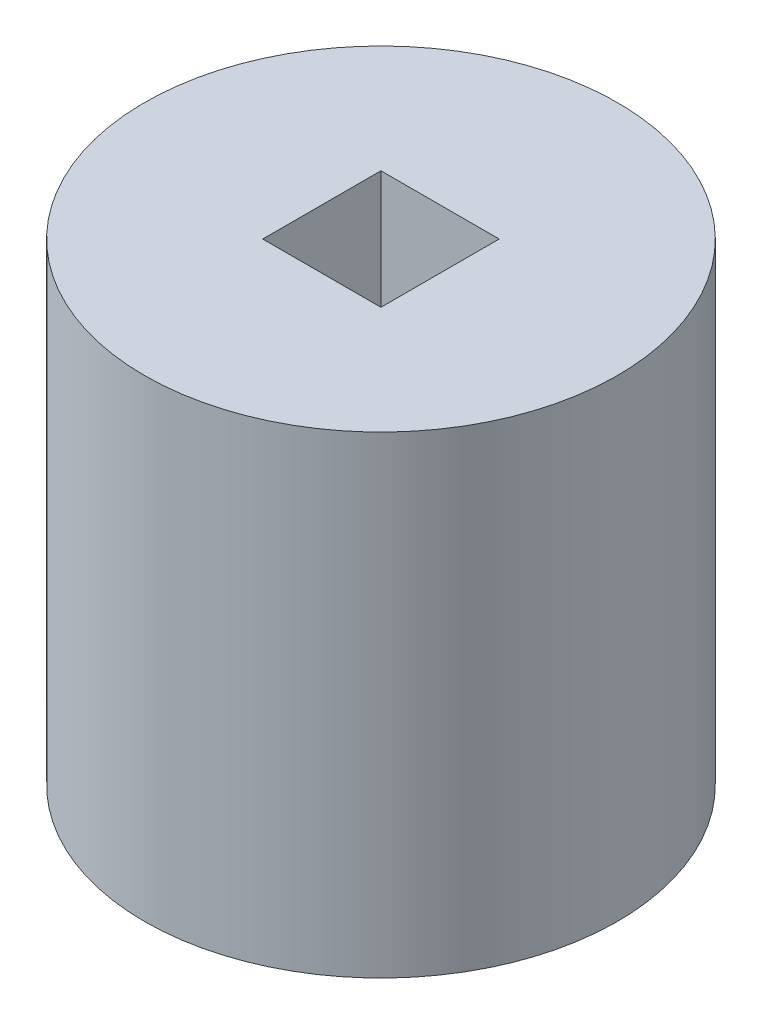
ISO-10303-21;
HEADER;
FILE_DESCRIPTION(('STEP AP214'),'2;1');
FILE_NAME('part.step','',(''),(''),'','','');
FILE_SCHEMA(('AUTOMOTIVE_DESIGN { 1 0 10303 214 1 1 1 1 }'));
ENDSEC;
DATA;
#1=APPLICATION_CONTEXT('core data for automotive mechanical design processes');
#2=APPLICATION_PROTOCOL_DEFINITION('international standard','automotive_design',2000,#1);
#3=PRODUCT_CONTEXT('',#1,'mechanical');
#4=PRODUCT('Part','Part','',(#3));
#5=PRODUCT_RELATED_PRODUCT_CATEGORY('part','',(#4));
#6=PRODUCT_DEFINITION_FORMATION('','',#4);
#7=PRODUCT_DEFINITION_CONTEXT('part definition',#1,'design');
#8=PRODUCT_DEFINITION('design','',#6,#7);
#9=PRODUCT_DEFINITION_SHAPE('','',#8);
#10=(LENGTH_UNIT() NAMED_UNIT(*) SI_UNIT(.MILLI.,.METRE.));
#11=(NAMED_UNIT(*) PLANE_ANGLE_UNIT() SI_UNIT($,.RADIAN.));
#12=(NAMED_UNIT(*) SI_UNIT($,.STERADIAN.) SOLID_ANGLE_UNIT());
#13=UNCERTAINTY_MEASURE_WITH_UNIT(LENGTH_MEASURE(1.E-05),#10,'distance_accuracy_value','');
#14=(GEOMETRIC_REPRESENTATION_CONTEXT(3) GLOBAL_UNCERTAINTY_ASSIGNED_CONTEXT((#13)) GLOBAL_UNIT_ASSIGNED_CONTEXT((#10,
#11,#12)) REPRESENTATION_CONTEXT('',''));
#15=CARTESIAN_POINT('',(0.,0.,0.));
#16=DIRECTION('',(0.,0.,1.));
#17=DIRECTION('',(1.,0.,0.));
#18=AXIS2_PLACEMENT_3D('',#15,#16,#17);
#19=CARTESIAN_POINT('',(0.,100.,0.));
#20=DIRECTION('',(0.,1.,0.));
#21=DIRECTION('',(0.,0.,1.));
#22=AXIS2_PLACEMENT_3D('',#19,#20,#21);
#23=PLANE('',#22);
#24=CARTESIAN_POINT('',(0.,100.,0.));
#25=DIRECTION('',(0.,1.,0.));
#26=DIRECTION('',(0.,0.,1.));
#27=AXIS2_PLACEMENT_3D('',#24,#25,#26);
#28=CIRCLE('',#27,50.);
#29=CARTESIAN_POINT('',(0.,100.,50.));
#30=VERTEX_POINT('',#29);
#31=EDGE_CURVE('E11',#30,#30,#28,.T.);
#32=ORIENTED_EDGE('',*,*,#31,.T.);
#33=EDGE_LOOP('',(#32));
#34=FACE_BOUND('',#33,.T.);
#35=DIRECTION('',(-1.,0.,0.));
#36=VECTOR('',#35,1.);
#37=CARTESIAN_POINT('',(-12.5,100.,-12.5));
#38=LINE('',#37,#36);
#39=CARTESIAN_POINT('',(12.5,100.,-12.5));
#40=VERTEX_POINT('',#39);
#41=CARTESIAN_POINT('',(-12.5,100.,-12.5));
#42=VERTEX_POINT('',#41);
#43=EDGE_CURVE('E90',#40,#42,#38,.T.);
#44=ORIENTED_EDGE('',*,*,#43,.F.);
#45=DIRECTION('',(0.,0.,-1.));
#46=VECTOR('',#45,1.);
#47=CARTESIAN_POINT('',(12.5,100.,-12.5));
#48=LINE('',#47,#46);
#49=CARTESIAN_POINT('',(12.5,100.,12.5));
#50=VERTEX_POINT('',#49);
#51=EDGE_CURVE('E81',#50,#40,#48,.T.);
#52=ORIENTED_EDGE('',*,*,#51,.F.);
#53=DIRECTION('',(1.,0.,0.));
#54=VECTOR('',#53,1.);
#55=CARTESIAN_POINT('',(-12.5,100.,12.5));
#56=LINE('',#55,#54);
#57=CARTESIAN_POINT('',(-12.5,100.,12.5));
#58=VERTEX_POINT('',#57);
#59=EDGE_CURVE('E106',#58,#50,#56,.T.);
#60=ORIENTED_EDGE('',*,*,#59,.F.);
#61=DIRECTION('',(0.,0.,1.));
#62=VECTOR('',#61,1.);
#63=CARTESIAN_POINT('',(-12.5,100.,-12.5));
#64=LINE('',#63,#62);
#65=EDGE_CURVE('E102',#42,#58,#64,.T.);
#66=ORIENTED_EDGE('',*,*,#65,.F.);
#67=EDGE_LOOP('',(#44,#52,#60,#66));
#68=FACE_BOUND('',#67,.T.);
#69=ADVANCED_FACE('F39',(#34,#68),#23,.T.);
#70=CARTESIAN_POINT('',(0.,0.,0.));
#71=DIRECTION('',(0.,1.,0.));
#72=DIRECTION('',(0.,0.,1.));
#73=AXIS2_PLACEMENT_3D('',#70,#71,#72);
#74=PLANE('',#73);
#75=CARTESIAN_POINT('',(0.,0.,0.));
#76=DIRECTION('',(0.,1.,0.));
#77=DIRECTION('',(0.,0.,1.));
#78=AXIS2_PLACEMENT_3D('',#75,#76,#77);
#79=CIRCLE('',#78,50.);
#80=CARTESIAN_POINT('',(0.,0.,50.));
#81=VERTEX_POINT('',#80);
#82=EDGE_CURVE('E43',#81,#81,#79,.T.);
#83=ORIENTED_EDGE('',*,*,#82,.F.);
#84=EDGE_LOOP('',(#83));
#85=FACE_BOUND('',#84,.T.);
#86=DIRECTION('',(0.,0.,-1.));
#87=VECTOR('',#86,1.);
#88=CARTESIAN_POINT('',(12.5,0.,-12.5));
#89=LINE('',#88,#87);
#90=CARTESIAN_POINT('',(12.5,0.,12.5));
#91=VERTEX_POINT('',#90);
#92=CARTESIAN_POINT('',(12.5,0.,-12.5));
#93=VERTEX_POINT('',#92);
#94=EDGE_CURVE('E63',#91,#93,#89,.T.);
#95=ORIENTED_EDGE('',*,*,#94,.T.);
#96=DIRECTION('',(-1.,0.,0.));
#97=VECTOR('',#96,1.);
#98=CARTESIAN_POINT('',(-12.5,0.,-12.5));
#99=LINE('',#98,#97);
#100=CARTESIAN_POINT('',(-12.5,0.,-12.5));
#101=VERTEX_POINT('',#100);
#102=EDGE_CURVE('E97',#93,#101,#99,.T.);
#103=ORIENTED_EDGE('',*,*,#102,.T.);
#104=DIRECTION('',(0.,0.,1.));
#105=VECTOR('',#104,1.);
#106=CARTESIAN_POINT('',(-12.5,0.,-12.5));
#107=LINE('',#106,#105);
#108=CARTESIAN_POINT('',(-12.5,0.,12.5));
#109=VERTEX_POINT('',#108);
#110=EDGE_CURVE('E115',#101,#109,#107,.T.);
#111=ORIENTED_EDGE('',*,*,#110,.T.);
#112=DIRECTION('',(1.,0.,0.));
#113=VECTOR('',#112,1.);
#114=CARTESIAN_POINT('',(-12.5,0.,12.5));
#115=LINE('',#114,#113);
#116=EDGE_CURVE('E91',#109,#91,#115,.T.);
#117=ORIENTED_EDGE('',*,*,#116,.T.);
#118=EDGE_LOOP('',(#95,#103,#111,#117));
#119=FACE_BOUND('',#118,.T.);
#120=ADVANCED_FACE('F131',(#85,#119),#74,.F.);
#121=CARTESIAN_POINT('',(0.,100.,0.));
#122=DIRECTION('',(0.,-1.,0.));
#123=DIRECTION('',(0.,0.,-1.));
#124=AXIS2_PLACEMENT_3D('',#121,#122,#123);
#125=CYLINDRICAL_SURFACE('',#124,50.);
#126=ORIENTED_EDGE('',*,*,#31,.F.);
#127=EDGE_LOOP('',(#126));
#128=FACE_BOUND('',#127,.T.);
#129=ORIENTED_EDGE('',*,*,#82,.T.);
#130=EDGE_LOOP('',(#129));
#131=FACE_BOUND('',#130,.T.);
#132=ADVANCED_FACE('F41',(#128,#131),#125,.T.);
#133=CARTESIAN_POINT('',(12.5,100.,-12.5));
#134=DIRECTION('',(-1.,0.,0.));
#135=DIRECTION('',(0.,0.,1.));
#136=AXIS2_PLACEMENT_3D('',#133,#134,#135);
#137=PLANE('',#136);
#138=ORIENTED_EDGE('',*,*,#94,.F.);
#139=DIRECTION('',(0.,-1.,0.));
#140=VECTOR('',#139,1.);
#141=CARTESIAN_POINT('',(12.5,100.,12.5));
#142=LINE('',#141,#140);
#143=EDGE_CURVE('E85',#50,#91,#142,.T.);
#144=ORIENTED_EDGE('',*,*,#143,.F.);
#145=ORIENTED_EDGE('',*,*,#51,.T.);
#146=DIRECTION('',(0.,-1.,0.));
#147=VECTOR('',#146,1.);
#148=CARTESIAN_POINT('',(12.5,100.,-12.5));
#149=LINE('',#148,#147);
#150=EDGE_CURVE('E84',#40,#93,#149,.T.);
#151=ORIENTED_EDGE('',*,*,#150,.T.);
#152=EDGE_LOOP('',(#138,#144,#145,#151));
#153=FACE_BOUND('',#152,.T.);
#154=ADVANCED_FACE('F83',(#153),#137,.T.);
#155=CARTESIAN_POINT('',(-12.5,100.,-12.5));
#156=DIRECTION('',(0.,0.,1.));
#157=DIRECTION('',(1.,0.,0.));
#158=AXIS2_PLACEMENT_3D('',#155,#156,#157);
#159=PLANE('',#158);
#160=ORIENTED_EDGE('',*,*,#102,.F.);
#161=ORIENTED_EDGE('',*,*,#150,.F.);
#162=ORIENTED_EDGE('',*,*,#43,.T.);
#163=DIRECTION('',(0.,-1.,0.));
#164=VECTOR('',#163,1.);
#165=CARTESIAN_POINT('',(-12.5,100.,-12.5));
#166=LINE('',#165,#164);
#167=EDGE_CURVE('E99',#42,#101,#166,.T.);
#168=ORIENTED_EDGE('',*,*,#167,.T.);
#169=EDGE_LOOP('',(#160,#161,#162,#168));
#170=FACE_BOUND('',#169,.T.);
#171=ADVANCED_FACE('F94',(#170),#159,.T.);
#172=CARTESIAN_POINT('',(-12.5,100.,-12.5));
#173=DIRECTION('',(1.,0.,0.));
#174=DIRECTION('',(0.,0.,-1.));
#175=AXIS2_PLACEMENT_3D('',#172,#173,#174);
#176=PLANE('',#175);
#177=ORIENTED_EDGE('',*,*,#110,.F.);
#178=ORIENTED_EDGE('',*,*,#167,.F.);
#179=ORIENTED_EDGE('',*,*,#65,.T.);
#180=DIRECTION('',(0.,-1.,0.));
#181=VECTOR('',#180,1.);
#182=CARTESIAN_POINT('',(-12.5,100.,12.5));
#183=LINE('',#182,#181);
#184=EDGE_CURVE('E55',#58,#109,#183,.T.);
#185=ORIENTED_EDGE('',*,*,#184,.T.);
#186=EDGE_LOOP('',(#177,#178,#179,#185));
#187=FACE_BOUND('',#186,.T.);
#188=ADVANCED_FACE('F129',(#187),#176,.T.);
#189=CARTESIAN_POINT('',(-12.5,100.,12.5));
#190=DIRECTION('',(0.,0.,-1.));
#191=DIRECTION('',(-1.,0.,0.));
#192=AXIS2_PLACEMENT_3D('',#189,#190,#191);
#193=PLANE('',#192);
#194=ORIENTED_EDGE('',*,*,#116,.F.);
#195=ORIENTED_EDGE('',*,*,#184,.F.);
#196=ORIENTED_EDGE('',*,*,#59,.T.);
#197=ORIENTED_EDGE('',*,*,#143,.T.);
#198=EDGE_LOOP('',(#194,#195,#196,#197));
#199=FACE_BOUND('',#198,.T.);
#200=ADVANCED_FACE('F132',(#199),#193,.T.);
#201=CLOSED_SHELL('',(#69,#120,#132,#154,#171,#188,#200));
#202=MANIFOLD_SOLID_BREP('B2',#201);
#203=ADVANCED_BREP_SHAPE_REPRESENTATION('',(#18,#202),#14);
#204=SHAPE_DEFINITION_REPRESENTATION(#9,#203);
ENDSEC;
END-ISO-10303-21;
